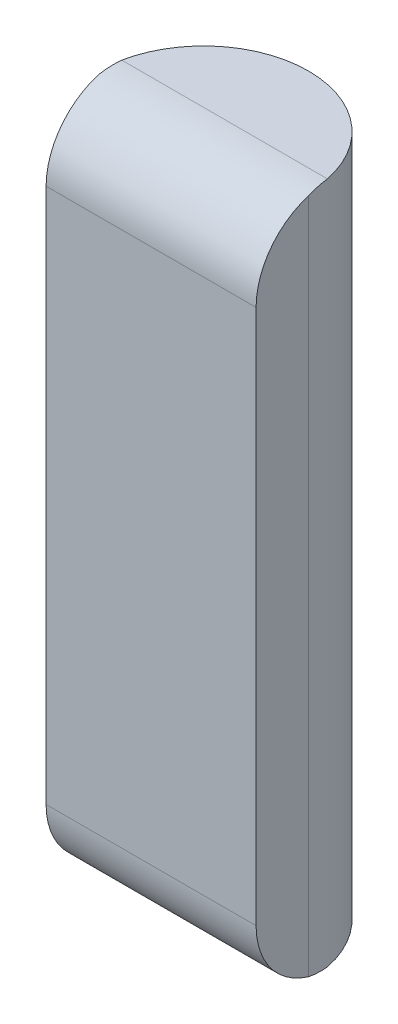
ISO-10303-21;
HEADER;
FILE_DESCRIPTION(('STEP AP214'),'2;1');
FILE_NAME('part.step','',(''),(''),'','','');
FILE_SCHEMA(('AUTOMOTIVE_DESIGN { 1 0 10303 214 1 1 1 1 }'));
ENDSEC;
DATA;
#1=APPLICATION_CONTEXT('core data for automotive mechanical design processes');
#2=APPLICATION_PROTOCOL_DEFINITION('international standard','automotive_design',2000,#1);
#3=PRODUCT_CONTEXT('',#1,'mechanical');
#4=PRODUCT('Part','Part','',(#3));
#5=PRODUCT_RELATED_PRODUCT_CATEGORY('part','',(#4));
#6=PRODUCT_DEFINITION_FORMATION('','',#4);
#7=PRODUCT_DEFINITION_CONTEXT('part definition',#1,'design');
#8=PRODUCT_DEFINITION('design','',#6,#7);
#9=PRODUCT_DEFINITION_SHAPE('','',#8);
#10=(LENGTH_UNIT() NAMED_UNIT(*) SI_UNIT(.MILLI.,.METRE.));
#11=(NAMED_UNIT(*) PLANE_ANGLE_UNIT() SI_UNIT($,.RADIAN.));
#12=(NAMED_UNIT(*) SI_UNIT($,.STERADIAN.) SOLID_ANGLE_UNIT());
#13=UNCERTAINTY_MEASURE_WITH_UNIT(LENGTH_MEASURE(1.E-05),#10,'distance_accuracy_value','');
#14=(GEOMETRIC_REPRESENTATION_CONTEXT(3) GLOBAL_UNCERTAINTY_ASSIGNED_CONTEXT((#13)) GLOBAL_UNIT_ASSIGNED_CONTEXT((#10,
#11,#12)) REPRESENTATION_CONTEXT('',''));
#15=CARTESIAN_POINT('',(0.,0.,0.));
#16=DIRECTION('',(0.,0.,1.));
#17=DIRECTION('',(1.,0.,0.));
#18=AXIS2_PLACEMENT_3D('',#15,#16,#17);
#19=CARTESIAN_POINT('',(0.2,0.,0.35));
#20=DIRECTION('',(0.,1.,0.));
#21=DIRECTION('',(0.,0.,-1.));
#22=AXIS2_PLACEMENT_3D('',#19,#20,#21);
#23=CYLINDRICAL_SURFACE('',#22,0.1);
#24=CARTESIAN_POINT('',(0.3,0.647082039324995,0.349999999999997));
#25=CARTESIAN_POINT('',(0.299915816237972,0.647323506050398,0.349190121189793));
#26=CARTESIAN_POINT('',(0.299831632475944,0.647550292569989,0.348375866058584));
#27=CARTESIAN_POINT('',(0.299663264951888,0.647974238368766,0.34673967912913));
#28=CARTESIAN_POINT('',(0.29957908118986,0.648171397647952,0.345917747330885));
#29=CARTESIAN_POINT('',(0.299410713665804,0.648535822137135,0.344267283042332));
#30=CARTESIAN_POINT('',(0.299326529903776,0.648703087347132,0.343438750552023));
#31=CARTESIAN_POINT('',(0.29915816237972,0.649007506544538,0.341776172212152));
#32=CARTESIAN_POINT('',(0.299073978617692,0.649144660531946,0.340942126362589));
#33=CARTESIAN_POINT('',(0.298905611093636,0.649388676630988,0.339269615138349));
#34=CARTESIAN_POINT('',(0.298821427331608,0.649495538742622,0.338431149763672));
#35=CARTESIAN_POINT('',(0.298653059807552,0.649678831688704,0.336750899341898));
#36=CARTESIAN_POINT('',(0.298568876045524,0.649755262523153,0.3359091142948));
#37=CARTESIAN_POINT('',(0.298400508521468,0.649877590349677,0.334223328579187));
#38=CARTESIAN_POINT('',(0.29831632475944,0.649923487341753,0.333379327910672));
#39=CARTESIAN_POINT('',(0.298147957235384,0.649984695768093,0.331690218311812));
#40=CARTESIAN_POINT('',(0.298063773473356,0.650000007202358,0.330845109381467));
#41=CARTESIAN_POINT('',(0.297979589711328,0.65,0.33));
#42=B_SPLINE_CURVE_WITH_KNOTS('',3,(#24,#25,#26,#27,#28,#29,#30,#31,#32,#33,#34,#35,#36,#37,#38,
#39,#40,#41),.UNSPECIFIED.,.F.,.F.,(4,2,2,2,2,2,2,2,4),(0.,0.00254773712594258,
0.00509547425188518,0.00764321137782766,0.0101909485037703,0.0127386856297129,
0.0152864227556554,0.017834159881598,0.0203818970075406),.UNSPECIFIED.);
#43=CARTESIAN_POINT('',(0.3,0.647082039324994,0.35));
#44=VERTEX_POINT('',#43);
#45=CARTESIAN_POINT('',(0.297979589711328,0.65,0.33));
#46=VERTEX_POINT('',#45);
#47=EDGE_CURVE('E11',#44,#46,#42,.T.);
#48=ORIENTED_EDGE('',*,*,#47,.F.);
#49=DIRECTION('',(0.,1.,0.));
#50=VECTOR('',#49,1.);
#51=CARTESIAN_POINT('',(0.3,0.,0.35));
#52=LINE('',#51,#50);
#53=CARTESIAN_POINT('',(0.3,0.00291796067500625,0.35));
#54=VERTEX_POINT('',#53);
#55=EDGE_CURVE('E25',#54,#44,#52,.T.);
#56=ORIENTED_EDGE('',*,*,#55,.F.);
#57=CARTESIAN_POINT('',(0.297979589711328,0.,0.33));
#58=CARTESIAN_POINT('',(0.298063773473356,-7.2023584028976E-09,0.330845109381467));
#59=CARTESIAN_POINT('',(0.298147957235384,1.53042319068318E-05,0.331690218311812));
#60=CARTESIAN_POINT('',(0.29831632475944,7.65126582475092E-05,0.333379327910672));
#61=CARTESIAN_POINT('',(0.298400508521468,0.000122409650322953,0.334223328579187));
#62=CARTESIAN_POINT('',(0.298568876045524,0.000244737476846979,0.3359091142948));
#63=CARTESIAN_POINT('',(0.298653059807552,0.000321168311295558,0.336750899341898));
#64=CARTESIAN_POINT('',(0.298821427331608,0.000504461257378012,0.338431149763672));
#65=CARTESIAN_POINT('',(0.298905611093636,0.000611323369011888,0.339269615138349));
#66=CARTESIAN_POINT('',(0.299073978617692,0.000855339468053771,0.340942126362589));
#67=CARTESIAN_POINT('',(0.29915816237972,0.000992493455461778,0.341776172212152));
#68=CARTESIAN_POINT('',(0.299326529903776,0.00129691265286742,0.343438750552023));
#69=CARTESIAN_POINT('',(0.299410713665804,0.00146417786286505,0.344267283042332));
#70=CARTESIAN_POINT('',(0.29957908118986,0.00182860235204828,0.345917747330885));
#71=CARTESIAN_POINT('',(0.299663264951888,0.00202576163123388,0.34673967912913));
#72=CARTESIAN_POINT('',(0.299831632475944,0.00244970743001086,0.348375866058584));
#73=CARTESIAN_POINT('',(0.299915816237972,0.00267649394960223,0.349190121189793));
#74=CARTESIAN_POINT('',(0.3,0.00291796067500539,0.349999999999997));
#75=B_SPLINE_CURVE_WITH_KNOTS('',3,(#57,#58,#59,#60,#61,#62,#63,#64,#65,#66,#67,#68,#69,#70,#71,
#72,#73,#74),.UNSPECIFIED.,.F.,.F.,(4,2,2,2,2,2,2,2,4),(0.,0.00254773712594255,
0.00509547425188523,0.00764321137782776,0.0101909485037704,0.012738685629713,0.0152864227556555,
0.0178341598815982,0.0203818970075407),.UNSPECIFIED.);
#76=CARTESIAN_POINT('',(0.297979589711328,0.,0.33));
#77=VERTEX_POINT('',#76);
#78=EDGE_CURVE('E171',#77,#54,#75,.T.);
#79=ORIENTED_EDGE('',*,*,#78,.F.);
#80=CARTESIAN_POINT('',(0.2,0.,0.35));
#81=DIRECTION('',(0.,1.,0.));
#82=DIRECTION('',(0.,0.,1.));
#83=AXIS2_PLACEMENT_3D('',#80,#81,#82);
#84=CIRCLE('',#83,0.1);
#85=CARTESIAN_POINT('',(0.102020410288673,0.,0.33));
#86=VERTEX_POINT('',#85);
#87=EDGE_CURVE('E206',#77,#86,#84,.T.);
#88=ORIENTED_EDGE('',*,*,#87,.T.);
#89=CARTESIAN_POINT('',(0.0999999999999999,0.00291796067500538,0.349999999999997));
#90=CARTESIAN_POINT('',(0.100084183762028,0.00267649394960223,0.349190121189793));
#91=CARTESIAN_POINT('',(0.100168367524056,0.00244970743001085,0.348375866058584));
#92=CARTESIAN_POINT('',(0.100336735048112,0.00202576163123387,0.34673967912913));
#93=CARTESIAN_POINT('',(0.10042091881014,0.00182860235204825,0.345917747330885));
#94=CARTESIAN_POINT('',(0.100589286334196,0.00146417786286502,0.344267283042332));
#95=CARTESIAN_POINT('',(0.100673470096224,0.0012969126528674,0.343438750552023));
#96=CARTESIAN_POINT('',(0.10084183762028,0.000992493455461767,0.341776172212152));
#97=CARTESIAN_POINT('',(0.100926021382308,0.000855339468053757,0.340942126362589));
#98=CARTESIAN_POINT('',(0.101094388906365,0.000611323369011878,0.339269615138349));
#99=CARTESIAN_POINT('',(0.101178572668393,0.000504461257378008,0.338431149763672));
#100=CARTESIAN_POINT('',(0.101346940192449,0.000321168311295559,0.336750899341898));
#101=CARTESIAN_POINT('',(0.101431123954477,0.00024473747684698,0.3359091142948));
#102=CARTESIAN_POINT('',(0.101599491478533,0.000122409650322956,0.334223328579187));
#103=CARTESIAN_POINT('',(0.101683675240561,7.65126582475104E-05,0.333379327910672));
#104=CARTESIAN_POINT('',(0.101852042764617,1.53042319068288E-05,0.331690218311812));
#105=CARTESIAN_POINT('',(0.101936226526645,-7.20235840720241E-09,0.330845109381467));
#106=CARTESIAN_POINT('',(0.102020410288673,0.,0.33));
#107=B_SPLINE_CURVE_WITH_KNOTS('',3,(#89,#90,#91,#92,#93,#94,#95,#96,#97,#98,#99,#100,#101,#102,
#103,#104,#105,#106),.UNSPECIFIED.,.F.,.F.,(4,2,2,2,2,2,2,2,4),(0.,0.00254773712594259,
0.00509547425188522,0.00764321137782782,0.0101909485037704,0.012738685629713,0.0152864227556556,
0.0178341598815982,0.0203818970075408),.UNSPECIFIED.);
#108=CARTESIAN_POINT('',(0.1,0.00291796067500621,0.35));
#109=VERTEX_POINT('',#108);
#110=EDGE_CURVE('E203',#109,#86,#107,.T.);
#111=ORIENTED_EDGE('',*,*,#110,.F.);
#112=DIRECTION('',(0.,1.,0.));
#113=VECTOR('',#112,1.);
#114=CARTESIAN_POINT('',(0.1,0.,0.35));
#115=LINE('',#114,#113);
#116=CARTESIAN_POINT('',(0.1,0.647082039324994,0.35));
#117=VERTEX_POINT('',#116);
#118=EDGE_CURVE('E75',#109,#117,#115,.T.);
#119=ORIENTED_EDGE('',*,*,#118,.T.);
#120=CARTESIAN_POINT('',(0.102020410288673,0.65,0.33));
#121=CARTESIAN_POINT('',(0.101936226526645,0.650000007202358,0.330845109381467));
#122=CARTESIAN_POINT('',(0.101852042764617,0.649984695768093,0.331690218311812));
#123=CARTESIAN_POINT('',(0.101683675240561,0.649923487341753,0.333379327910672));
#124=CARTESIAN_POINT('',(0.101599491478533,0.649877590349677,0.334223328579187));
#125=CARTESIAN_POINT('',(0.101431123954477,0.649755262523153,0.3359091142948));
#126=CARTESIAN_POINT('',(0.101346940192449,0.649678831688704,0.336750899341897));
#127=CARTESIAN_POINT('',(0.101178572668393,0.649495538742622,0.338431149763672));
#128=CARTESIAN_POINT('',(0.101094388906365,0.649388676630988,0.339269615138349));
#129=CARTESIAN_POINT('',(0.100926021382308,0.649144660531946,0.340942126362589));
#130=CARTESIAN_POINT('',(0.10084183762028,0.649007506544538,0.341776172212152));
#131=CARTESIAN_POINT('',(0.100673470096224,0.648703087347132,0.343438750552023));
#132=CARTESIAN_POINT('',(0.100589286334196,0.648535822137135,0.344267283042332));
#133=CARTESIAN_POINT('',(0.10042091881014,0.648171397647952,0.345917747330885));
#134=CARTESIAN_POINT('',(0.100336735048112,0.647974238368766,0.34673967912913));
#135=CARTESIAN_POINT('',(0.100168367524056,0.647550292569989,0.348375866058584));
#136=CARTESIAN_POINT('',(0.100084183762028,0.647323506050398,0.349190121189793));
#137=CARTESIAN_POINT('',(0.1,0.647082039324995,0.349999999999997));
#138=B_SPLINE_CURVE_WITH_KNOTS('',3,(#120,#121,#122,#123,#124,#125,#126,#127,#128,#129,#130,
#131,#132,#133,#134,#135,#136,#137),.UNSPECIFIED.,.F.,.F.,(4,2,2,2,2,2,2,2,4),(0.,
0.00254773712594256,0.00509547425188514,0.00764321137782775,0.0101909485037704,
0.0127386856297129,0.0152864227556555,0.0178341598815981,0.0203818970075407),.UNSPECIFIED.);
#139=CARTESIAN_POINT('',(0.102020410288673,0.65,0.33));
#140=VERTEX_POINT('',#139);
#141=EDGE_CURVE('E125',#140,#117,#138,.T.);
#142=ORIENTED_EDGE('',*,*,#141,.F.);
#143=CARTESIAN_POINT('',(0.2,0.65,0.35));
#144=DIRECTION('',(0.,1.,0.));
#145=DIRECTION('',(0.,0.,1.));
#146=AXIS2_PLACEMENT_3D('',#143,#144,#145);
#147=CIRCLE('',#146,0.1);
#148=EDGE_CURVE('E120',#46,#140,#147,.T.);
#149=ORIENTED_EDGE('',*,*,#148,.F.);
#150=EDGE_LOOP('',(#48,#56,#79,#88,#111,#119,#142,#149));
#151=FACE_BOUND('',#150,.T.);
#152=ADVANCED_FACE('F17',(#151),#23,.T.);
#153=CARTESIAN_POINT('',(0.3,0.,0.35));
#154=DIRECTION('',(1.,0.,0.));
#155=DIRECTION('',(0.,0.,-1.));
#156=AXIS2_PLACEMENT_3D('',#153,#154,#155);
#157=PLANE('',#156);
#158=CARTESIAN_POINT('',(0.300000000000001,0.58,0.33));
#159=DIRECTION('',(-1.,0.,0.));
#160=DIRECTION('',(0.,0.,-1.));
#161=AXIS2_PLACEMENT_3D('',#158,#159,#160);
#162=CIRCLE('',#161,0.07);
#163=CARTESIAN_POINT('',(0.300000000000001,0.58,0.4));
#164=VERTEX_POINT('',#163);
#165=EDGE_CURVE('E116',#164,#44,#162,.T.);
#166=ORIENTED_EDGE('',*,*,#165,.F.);
#167=DIRECTION('',(0.,-1.,0.));
#168=VECTOR('',#167,1.);
#169=CARTESIAN_POINT('',(0.3,0.65,0.4));
#170=LINE('',#169,#168);
#171=CARTESIAN_POINT('',(0.300000000000001,0.07,0.4));
#172=VERTEX_POINT('',#171);
#173=EDGE_CURVE('E114',#164,#172,#170,.T.);
#174=ORIENTED_EDGE('',*,*,#173,.T.);
#175=CARTESIAN_POINT('',(0.300000000000001,0.07,0.33));
#176=DIRECTION('',(-1.,0.,0.));
#177=DIRECTION('',(0.,0.,-1.));
#178=AXIS2_PLACEMENT_3D('',#175,#176,#177);
#179=CIRCLE('',#178,0.07);
#180=EDGE_CURVE('E94',#54,#172,#179,.T.);
#181=ORIENTED_EDGE('',*,*,#180,.F.);
#182=ORIENTED_EDGE('',*,*,#55,.T.);
#183=EDGE_LOOP('',(#166,#174,#181,#182));
#184=FACE_BOUND('',#183,.T.);
#185=ADVANCED_FACE('F226',(#184),#157,.T.);
#186=CARTESIAN_POINT('',(0.1,0.,0.4));
#187=DIRECTION('',(-1.,0.,0.));
#188=DIRECTION('',(0.,0.,1.));
#189=AXIS2_PLACEMENT_3D('',#186,#187,#188);
#190=PLANE('',#189);
#191=CARTESIAN_POINT('',(0.1,0.58,0.33));
#192=DIRECTION('',(1.,0.,0.));
#193=DIRECTION('',(0.,0.,1.));
#194=AXIS2_PLACEMENT_3D('',#191,#192,#193);
#195=CIRCLE('',#194,0.07);
#196=CARTESIAN_POINT('',(0.1,0.58,0.4));
#197=VERTEX_POINT('',#196);
#198=EDGE_CURVE('E79',#117,#197,#195,.T.);
#199=ORIENTED_EDGE('',*,*,#198,.F.);
#200=ORIENTED_EDGE('',*,*,#118,.F.);
#201=CARTESIAN_POINT('',(0.1,0.07,0.33));
#202=DIRECTION('',(1.,0.,0.));
#203=DIRECTION('',(0.,0.,1.));
#204=AXIS2_PLACEMENT_3D('',#201,#202,#203);
#205=CIRCLE('',#204,0.07);
#206=CARTESIAN_POINT('',(0.1,0.07,0.4));
#207=VERTEX_POINT('',#206);
#208=EDGE_CURVE('E69',#207,#109,#205,.T.);
#209=ORIENTED_EDGE('',*,*,#208,.F.);
#210=DIRECTION('',(0.,1.,0.));
#211=VECTOR('',#210,1.);
#212=CARTESIAN_POINT('',(0.1,0.,0.4));
#213=LINE('',#212,#211);
#214=EDGE_CURVE('E73',#207,#197,#213,.T.);
#215=ORIENTED_EDGE('',*,*,#214,.T.);
#216=EDGE_LOOP('',(#199,#200,#209,#215));
#217=FACE_BOUND('',#216,.T.);
#218=ADVANCED_FACE('F72',(#217),#190,.T.);
#219=CARTESIAN_POINT('',(0.,0.58,0.33));
#220=DIRECTION('',(-1.,0.,0.));
#221=DIRECTION('',(0.,0.,1.));
#222=AXIS2_PLACEMENT_3D('',#219,#220,#221);
#223=CYLINDRICAL_SURFACE('',#222,0.07);
#224=DIRECTION('',(1.,0.,0.));
#225=VECTOR('',#224,1.);
#226=CARTESIAN_POINT('',(0.8,0.65,0.33));
#227=LINE('',#226,#225);
#228=EDGE_CURVE('E88',#140,#46,#227,.T.);
#229=ORIENTED_EDGE('',*,*,#228,.F.);
#230=ORIENTED_EDGE('',*,*,#141,.T.);
#231=ORIENTED_EDGE('',*,*,#198,.T.);
#232=DIRECTION('',(-1.,0.,0.));
#233=VECTOR('',#232,1.);
#234=CARTESIAN_POINT('',(-0.8,0.58,0.4));
#235=LINE('',#234,#233);
#236=EDGE_CURVE('E87',#164,#197,#235,.T.);
#237=ORIENTED_EDGE('',*,*,#236,.F.);
#238=ORIENTED_EDGE('',*,*,#165,.T.);
#239=ORIENTED_EDGE('',*,*,#47,.T.);
#240=EDGE_LOOP('',(#229,#230,#231,#237,#238,#239));
#241=FACE_BOUND('',#240,.T.);
#242=ADVANCED_FACE('F141',(#241),#223,.T.);
#243=CARTESIAN_POINT('',(0.,0.65,0.));
#244=DIRECTION('',(0.,1.,0.));
#245=DIRECTION('',(0.,0.,1.));
#246=AXIS2_PLACEMENT_3D('',#243,#244,#245);
#247=PLANE('',#246);
#248=ORIENTED_EDGE('',*,*,#228,.T.);
#249=ORIENTED_EDGE('',*,*,#148,.T.);
#250=EDGE_LOOP('',(#248,#249));
#251=FACE_BOUND('',#250,.T.);
#252=ADVANCED_FACE('F151',(#251),#247,.T.);
#253=CARTESIAN_POINT('',(0.8,0.65,0.4));
#254=DIRECTION('',(0.,0.,-1.));
#255=DIRECTION('',(-1.,0.,0.));
#256=AXIS2_PLACEMENT_3D('',#253,#254,#255);
#257=PLANE('',#256);
#258=ORIENTED_EDGE('',*,*,#214,.F.);
#259=DIRECTION('',(1.,0.,0.));
#260=VECTOR('',#259,1.);
#261=CARTESIAN_POINT('',(0.8,0.07,0.4));
#262=LINE('',#261,#260);
#263=EDGE_CURVE('E85',#207,#172,#262,.T.);
#264=ORIENTED_EDGE('',*,*,#263,.T.);
#265=ORIENTED_EDGE('',*,*,#173,.F.);
#266=ORIENTED_EDGE('',*,*,#236,.T.);
#267=EDGE_LOOP('',(#258,#264,#265,#266));
#268=FACE_BOUND('',#267,.T.);
#269=ADVANCED_FACE('F83',(#268),#257,.F.);
#270=CARTESIAN_POINT('',(0.8,0.07,0.33));
#271=DIRECTION('',(1.,0.,0.));
#272=DIRECTION('',(0.,0.,-1.));
#273=AXIS2_PLACEMENT_3D('',#270,#271,#272);
#274=CYLINDRICAL_SURFACE('',#273,0.07);
#275=ORIENTED_EDGE('',*,*,#208,.T.);
#276=ORIENTED_EDGE('',*,*,#110,.T.);
#277=DIRECTION('',(-1.,0.,0.));
#278=VECTOR('',#277,1.);
#279=CARTESIAN_POINT('',(0.,0.,0.33));
#280=LINE('',#279,#278);
#281=EDGE_CURVE('E95',#77,#86,#280,.T.);
#282=ORIENTED_EDGE('',*,*,#281,.F.);
#283=ORIENTED_EDGE('',*,*,#78,.T.);
#284=ORIENTED_EDGE('',*,*,#180,.T.);
#285=ORIENTED_EDGE('',*,*,#263,.F.);
#286=EDGE_LOOP('',(#275,#276,#282,#283,#284,#285));
#287=FACE_BOUND('',#286,.T.);
#288=ADVANCED_FACE('F91',(#287),#274,.T.);
#289=CARTESIAN_POINT('',(0.,0.,0.));
#290=DIRECTION('',(0.,1.,0.));
#291=DIRECTION('',(0.,0.,1.));
#292=AXIS2_PLACEMENT_3D('',#289,#290,#291);
#293=PLANE('',#292);
#294=ORIENTED_EDGE('',*,*,#87,.F.);
#295=ORIENTED_EDGE('',*,*,#281,.T.);
#296=EDGE_LOOP('',(#294,#295));
#297=FACE_BOUND('',#296,.T.);
#298=ADVANCED_FACE('F189',(#297),#293,.F.);
#299=CLOSED_SHELL('',(#152,#185,#218,#242,#252,#269,#288,#298));
#300=MANIFOLD_SOLID_BREP('B1',#299);
#301=ADVANCED_BREP_SHAPE_REPRESENTATION('',(#18,#300),#14);
#302=SHAPE_DEFINITION_REPRESENTATION(#9,#301);
ENDSEC;
END-ISO-10303-21;
